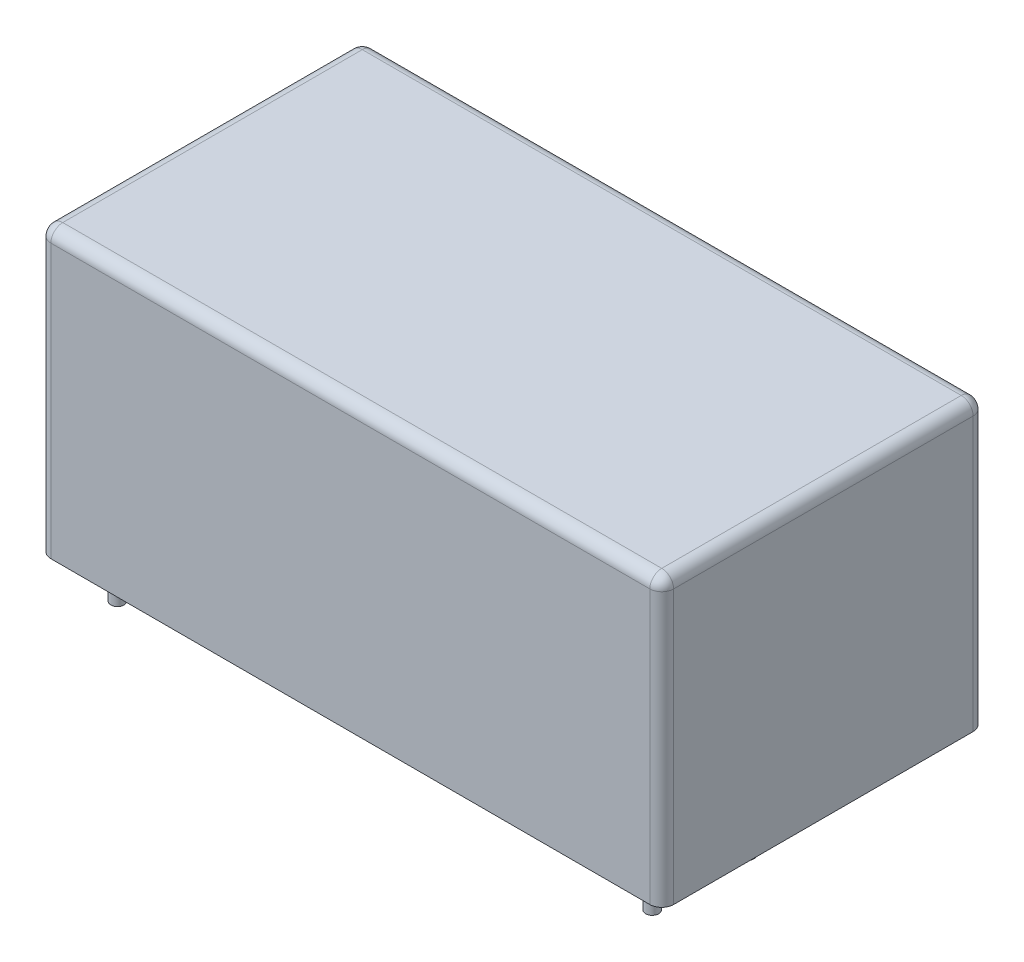
ISO-10303-21;
HEADER;
FILE_DESCRIPTION(('STEP AP214'),'2;1');
FILE_NAME('part.step','',(''),(''),'','','');
FILE_SCHEMA(('AUTOMOTIVE_DESIGN { 1 0 10303 214 1 1 1 1 }'));
ENDSEC;
DATA;
#1=APPLICATION_CONTEXT('core data for automotive mechanical design processes');
#2=APPLICATION_PROTOCOL_DEFINITION('international standard','automotive_design',2000,#1);
#3=PRODUCT_CONTEXT('',#1,'mechanical');
#4=PRODUCT('Part','Part','',(#3));
#5=PRODUCT_RELATED_PRODUCT_CATEGORY('part','',(#4));
#6=PRODUCT_DEFINITION_FORMATION('','',#4);
#7=PRODUCT_DEFINITION_CONTEXT('part definition',#1,'design');
#8=PRODUCT_DEFINITION('design','',#6,#7);
#9=PRODUCT_DEFINITION_SHAPE('','',#8);
#10=(LENGTH_UNIT() NAMED_UNIT(*) SI_UNIT(.MILLI.,.METRE.));
#11=(NAMED_UNIT(*) PLANE_ANGLE_UNIT() SI_UNIT($,.RADIAN.));
#12=(NAMED_UNIT(*) SI_UNIT($,.STERADIAN.) SOLID_ANGLE_UNIT());
#13=UNCERTAINTY_MEASURE_WITH_UNIT(LENGTH_MEASURE(1.E-05),#10,'distance_accuracy_value','');
#14=(GEOMETRIC_REPRESENTATION_CONTEXT(3) GLOBAL_UNCERTAINTY_ASSIGNED_CONTEXT((#13)) GLOBAL_UNIT_ASSIGNED_CONTEXT((#10,
#11,#12)) REPRESENTATION_CONTEXT('',''));
#15=CARTESIAN_POINT('',(0.,0.,0.));
#16=DIRECTION('',(0.,0.,1.));
#17=DIRECTION('',(1.,0.,0.));
#18=AXIS2_PLACEMENT_3D('',#15,#16,#17);
#19=CARTESIAN_POINT('',(25.2,24.,-12.6));
#20=DIRECTION('',(0.,-1.,0.));
#21=DIRECTION('',(0.,0.,-1.));
#22=AXIS2_PLACEMENT_3D('',#19,#20,#21);
#23=CYLINDRICAL_SURFACE('',#22,1.);
#24=DIRECTION('',(0.,-1.,0.));
#25=VECTOR('',#24,1.);
#26=CARTESIAN_POINT('',(25.2,24.,-13.6));
#27=LINE('',#26,#25);
#28=CARTESIAN_POINT('',(25.2,23.,-13.6));
#29=VERTEX_POINT('',#28);
#30=CARTESIAN_POINT('',(25.2,0.,-13.6));
#31=VERTEX_POINT('',#30);
#32=EDGE_CURVE('E115',#29,#31,#27,.T.);
#33=ORIENTED_EDGE('',*,*,#32,.F.);
#34=CARTESIAN_POINT('',(25.2,23.,-12.6));
#35=DIRECTION('',(0.,-1.,0.));
#36=DIRECTION('',(0.,0.,-1.));
#37=AXIS2_PLACEMENT_3D('',#34,#35,#36);
#38=CIRCLE('',#37,1.);
#39=CARTESIAN_POINT('',(26.2,23.,-12.6));
#40=VERTEX_POINT('',#39);
#41=EDGE_CURVE('E179',#29,#40,#38,.T.);
#42=ORIENTED_EDGE('',*,*,#41,.T.);
#43=DIRECTION('',(0.,-1.,0.));
#44=VECTOR('',#43,1.);
#45=CARTESIAN_POINT('',(26.2,24.,-12.6));
#46=LINE('',#45,#44);
#47=CARTESIAN_POINT('',(26.2,0.,-12.6));
#48=VERTEX_POINT('',#47);
#49=EDGE_CURVE('E139',#40,#48,#46,.T.);
#50=ORIENTED_EDGE('',*,*,#49,.T.);
#51=CARTESIAN_POINT('',(25.2,0.,-12.6));
#52=DIRECTION('',(0.,1.,0.));
#53=DIRECTION('',(0.,0.,-1.));
#54=AXIS2_PLACEMENT_3D('',#51,#52,#53);
#55=CIRCLE('',#54,1.);
#56=EDGE_CURVE('E133',#48,#31,#55,.T.);
#57=ORIENTED_EDGE('',*,*,#56,.T.);
#58=EDGE_LOOP('',(#33,#42,#50,#57));
#59=FACE_BOUND('',#58,.T.);
#60=ADVANCED_FACE('F37',(#59),#23,.T.);
#61=CARTESIAN_POINT('',(-25.2,24.,-13.6));
#62=DIRECTION('',(0.,0.,1.));
#63=DIRECTION('',(1.,0.,0.));
#64=AXIS2_PLACEMENT_3D('',#61,#62,#63);
#65=PLANE('',#64);
#66=DIRECTION('',(0.,-1.,0.));
#67=VECTOR('',#66,1.);
#68=CARTESIAN_POINT('',(-25.2,24.,-13.6));
#69=LINE('',#68,#67);
#70=CARTESIAN_POINT('',(-25.2,23.,-13.6));
#71=VERTEX_POINT('',#70);
#72=CARTESIAN_POINT('',(-25.2,0.,-13.6));
#73=VERTEX_POINT('',#72);
#74=EDGE_CURVE('E127',#71,#73,#69,.T.);
#75=ORIENTED_EDGE('',*,*,#74,.F.);
#76=DIRECTION('',(-1.,0.,0.));
#77=VECTOR('',#76,1.);
#78=CARTESIAN_POINT('',(-25.2,23.,-13.6));
#79=LINE('',#78,#77);
#80=EDGE_CURVE('E122',#71,#29,#79,.F.);
#81=ORIENTED_EDGE('',*,*,#80,.T.);
#82=ORIENTED_EDGE('',*,*,#32,.T.);
#83=DIRECTION('',(-1.,0.,0.));
#84=VECTOR('',#83,1.);
#85=CARTESIAN_POINT('',(-25.2,0.,-13.6));
#86=LINE('',#85,#84);
#87=EDGE_CURVE('E119',#31,#73,#86,.T.);
#88=ORIENTED_EDGE('',*,*,#87,.T.);
#89=EDGE_LOOP('',(#75,#81,#82,#88));
#90=FACE_BOUND('',#89,.T.);
#91=ADVANCED_FACE('F118',(#90),#65,.F.);
#92=CARTESIAN_POINT('',(-25.2,24.,-12.6));
#93=DIRECTION('',(0.,-1.,0.));
#94=DIRECTION('',(0.,0.,-1.));
#95=AXIS2_PLACEMENT_3D('',#92,#93,#94);
#96=CYLINDRICAL_SURFACE('',#95,1.);
#97=DIRECTION('',(0.,-1.,0.));
#98=VECTOR('',#97,1.);
#99=CARTESIAN_POINT('',(-26.2,24.,-12.6));
#100=LINE('',#99,#98);
#101=CARTESIAN_POINT('',(-26.2,23.,-12.6));
#102=VERTEX_POINT('',#101);
#103=CARTESIAN_POINT('',(-26.2,0.,-12.6));
#104=VERTEX_POINT('',#103);
#105=EDGE_CURVE('E172',#102,#104,#100,.T.);
#106=ORIENTED_EDGE('',*,*,#105,.F.);
#107=CARTESIAN_POINT('',(-25.2,23.,-12.6));
#108=DIRECTION('',(0.,-1.,0.));
#109=DIRECTION('',(0.,0.,-1.));
#110=AXIS2_PLACEMENT_3D('',#107,#108,#109);
#111=CIRCLE('',#110,1.);
#112=EDGE_CURVE('E177',#102,#71,#111,.T.);
#113=ORIENTED_EDGE('',*,*,#112,.T.);
#114=ORIENTED_EDGE('',*,*,#74,.T.);
#115=CARTESIAN_POINT('',(-25.2,0.,-12.6));
#116=DIRECTION('',(0.,1.,0.));
#117=DIRECTION('',(0.,0.,-1.));
#118=AXIS2_PLACEMENT_3D('',#115,#116,#117);
#119=CIRCLE('',#118,1.);
#120=EDGE_CURVE('E136',#73,#104,#119,.T.);
#121=ORIENTED_EDGE('',*,*,#120,.T.);
#122=EDGE_LOOP('',(#106,#113,#114,#121));
#123=FACE_BOUND('',#122,.T.);
#124=ADVANCED_FACE('F263',(#123),#96,.T.);
#125=CARTESIAN_POINT('',(-26.2,24.,-12.6));
#126=DIRECTION('',(1.,0.,0.));
#127=DIRECTION('',(0.,0.,-1.));
#128=AXIS2_PLACEMENT_3D('',#125,#126,#127);
#129=PLANE('',#128);
#130=DIRECTION('',(0.,-1.,0.));
#131=VECTOR('',#130,1.);
#132=CARTESIAN_POINT('',(-26.2,24.,12.6));
#133=LINE('',#132,#131);
#134=CARTESIAN_POINT('',(-26.2,23.,12.6));
#135=VERTEX_POINT('',#134);
#136=CARTESIAN_POINT('',(-26.2,0.,12.6));
#137=VERTEX_POINT('',#136);
#138=EDGE_CURVE('E170',#135,#137,#133,.T.);
#139=ORIENTED_EDGE('',*,*,#138,.F.);
#140=DIRECTION('',(0.,0.,1.));
#141=VECTOR('',#140,1.);
#142=CARTESIAN_POINT('',(-26.2,23.,-12.6));
#143=LINE('',#142,#141);
#144=EDGE_CURVE('E189',#135,#102,#143,.F.);
#145=ORIENTED_EDGE('',*,*,#144,.T.);
#146=ORIENTED_EDGE('',*,*,#105,.T.);
#147=DIRECTION('',(0.,0.,1.));
#148=VECTOR('',#147,1.);
#149=CARTESIAN_POINT('',(-26.2,0.,-12.6));
#150=LINE('',#149,#148);
#151=EDGE_CURVE('E149',#104,#137,#150,.T.);
#152=ORIENTED_EDGE('',*,*,#151,.T.);
#153=EDGE_LOOP('',(#139,#145,#146,#152));
#154=FACE_BOUND('',#153,.T.);
#155=ADVANCED_FACE('F454',(#154),#129,.F.);
#156=CARTESIAN_POINT('',(-25.2,24.,12.6));
#157=DIRECTION('',(0.,-1.,0.));
#158=DIRECTION('',(0.,0.,-1.));
#159=AXIS2_PLACEMENT_3D('',#156,#157,#158);
#160=CYLINDRICAL_SURFACE('',#159,0.999999999999998);
#161=DIRECTION('',(0.,-1.,0.));
#162=VECTOR('',#161,1.);
#163=CARTESIAN_POINT('',(-25.2,24.,13.6));
#164=LINE('',#163,#162);
#165=CARTESIAN_POINT('',(-25.2,23.,13.6));
#166=VERTEX_POINT('',#165);
#167=CARTESIAN_POINT('',(-25.2,0.,13.6));
#168=VERTEX_POINT('',#167);
#169=EDGE_CURVE('E168',#166,#168,#164,.T.);
#170=ORIENTED_EDGE('',*,*,#169,.F.);
#171=CARTESIAN_POINT('',(-25.2,23.,12.6));
#172=DIRECTION('',(0.,-1.,0.));
#173=DIRECTION('',(0.,0.,-1.));
#174=AXIS2_PLACEMENT_3D('',#171,#172,#173);
#175=CIRCLE('',#174,0.999999999999998);
#176=EDGE_CURVE('E126',#166,#135,#175,.T.);
#177=ORIENTED_EDGE('',*,*,#176,.T.);
#178=ORIENTED_EDGE('',*,*,#138,.T.);
#179=CARTESIAN_POINT('',(-25.2,0.,12.6));
#180=DIRECTION('',(0.,1.,0.));
#181=DIRECTION('',(0.,0.,-1.));
#182=AXIS2_PLACEMENT_3D('',#179,#180,#181);
#183=CIRCLE('',#182,0.999999999999998);
#184=EDGE_CURVE('E152',#137,#168,#183,.T.);
#185=ORIENTED_EDGE('',*,*,#184,.T.);
#186=EDGE_LOOP('',(#170,#177,#178,#185));
#187=FACE_BOUND('',#186,.T.);
#188=ADVANCED_FACE('F445',(#187),#160,.T.);
#189=CARTESIAN_POINT('',(-25.2,24.,13.6));
#190=DIRECTION('',(0.,0.,-1.));
#191=DIRECTION('',(-1.,0.,0.));
#192=AXIS2_PLACEMENT_3D('',#189,#190,#191);
#193=PLANE('',#192);
#194=DIRECTION('',(0.,-1.,0.));
#195=VECTOR('',#194,1.);
#196=CARTESIAN_POINT('',(25.2,24.,13.6));
#197=LINE('',#196,#195);
#198=CARTESIAN_POINT('',(25.2,23.,13.6));
#199=VERTEX_POINT('',#198);
#200=CARTESIAN_POINT('',(25.2,0.,13.6));
#201=VERTEX_POINT('',#200);
#202=EDGE_CURVE('E166',#199,#201,#197,.T.);
#203=ORIENTED_EDGE('',*,*,#202,.F.);
#204=DIRECTION('',(1.,0.,0.));
#205=VECTOR('',#204,1.);
#206=CARTESIAN_POINT('',(-25.2,23.,13.6));
#207=LINE('',#206,#205);
#208=EDGE_CURVE('E11',#199,#166,#207,.F.);
#209=ORIENTED_EDGE('',*,*,#208,.T.);
#210=ORIENTED_EDGE('',*,*,#169,.T.);
#211=DIRECTION('',(1.,0.,0.));
#212=VECTOR('',#211,1.);
#213=CARTESIAN_POINT('',(-25.2,0.,13.6));
#214=LINE('',#213,#212);
#215=EDGE_CURVE('E155',#168,#201,#214,.T.);
#216=ORIENTED_EDGE('',*,*,#215,.T.);
#217=EDGE_LOOP('',(#203,#209,#210,#216));
#218=FACE_BOUND('',#217,.T.);
#219=ADVANCED_FACE('F242',(#218),#193,.F.);
#220=CARTESIAN_POINT('',(25.2,24.,12.6));
#221=DIRECTION('',(0.,-1.,0.));
#222=DIRECTION('',(0.,0.,-1.));
#223=AXIS2_PLACEMENT_3D('',#220,#221,#222);
#224=CYLINDRICAL_SURFACE('',#223,1.);
#225=DIRECTION('',(0.,-1.,0.));
#226=VECTOR('',#225,1.);
#227=CARTESIAN_POINT('',(26.2,24.,12.6));
#228=LINE('',#227,#226);
#229=CARTESIAN_POINT('',(26.2,23.,12.6));
#230=VERTEX_POINT('',#229);
#231=CARTESIAN_POINT('',(26.2,0.,12.6));
#232=VERTEX_POINT('',#231);
#233=EDGE_CURVE('E164',#230,#232,#228,.T.);
#234=ORIENTED_EDGE('',*,*,#233,.F.);
#235=CARTESIAN_POINT('',(25.2,23.,12.6));
#236=DIRECTION('',(0.,-1.,0.));
#237=DIRECTION('',(0.,0.,-1.));
#238=AXIS2_PLACEMENT_3D('',#235,#236,#237);
#239=CIRCLE('',#238,1.);
#240=EDGE_CURVE('E181',#230,#199,#239,.T.);
#241=ORIENTED_EDGE('',*,*,#240,.T.);
#242=ORIENTED_EDGE('',*,*,#202,.T.);
#243=CARTESIAN_POINT('',(25.2,0.,12.6));
#244=DIRECTION('',(0.,1.,0.));
#245=DIRECTION('',(0.,0.,-1.));
#246=AXIS2_PLACEMENT_3D('',#243,#244,#245);
#247=CIRCLE('',#246,1.);
#248=EDGE_CURVE('E158',#201,#232,#247,.T.);
#249=ORIENTED_EDGE('',*,*,#248,.T.);
#250=EDGE_LOOP('',(#234,#241,#242,#249));
#251=FACE_BOUND('',#250,.T.);
#252=ADVANCED_FACE('F240',(#251),#224,.T.);
#253=CARTESIAN_POINT('',(26.2,24.,-12.6));
#254=DIRECTION('',(-1.,0.,0.));
#255=DIRECTION('',(0.,0.,1.));
#256=AXIS2_PLACEMENT_3D('',#253,#254,#255);
#257=PLANE('',#256);
#258=ORIENTED_EDGE('',*,*,#49,.F.);
#259=DIRECTION('',(0.,0.,-1.));
#260=VECTOR('',#259,1.);
#261=CARTESIAN_POINT('',(26.2,23.,-12.6));
#262=LINE('',#261,#260);
#263=EDGE_CURVE('E46',#40,#230,#262,.F.);
#264=ORIENTED_EDGE('',*,*,#263,.T.);
#265=ORIENTED_EDGE('',*,*,#233,.T.);
#266=DIRECTION('',(0.,0.,-1.));
#267=VECTOR('',#266,1.);
#268=CARTESIAN_POINT('',(26.2,0.,-12.6));
#269=LINE('',#268,#267);
#270=EDGE_CURVE('E161',#232,#48,#269,.T.);
#271=ORIENTED_EDGE('',*,*,#270,.T.);
#272=EDGE_LOOP('',(#258,#264,#265,#271));
#273=FACE_BOUND('',#272,.T.);
#274=ADVANCED_FACE('F248',(#273),#257,.F.);
#275=CARTESIAN_POINT('',(25.2,24.,-12.6));
#276=DIRECTION('',(0.,-1.,0.));
#277=DIRECTION('',(0.,0.,-1.));
#278=AXIS2_PLACEMENT_3D('',#275,#276,#277);
#279=PLANE('',#278);
#280=DIRECTION('',(-1.,0.,0.));
#281=VECTOR('',#280,1.);
#282=CARTESIAN_POINT('',(25.2,24.,-12.6));
#283=LINE('',#282,#281);
#284=CARTESIAN_POINT('',(25.2,24.,-12.6));
#285=VERTEX_POINT('',#284);
#286=CARTESIAN_POINT('',(-25.2,24.,-12.6));
#287=VERTEX_POINT('',#286);
#288=EDGE_CURVE('E54',#285,#287,#283,.T.);
#289=ORIENTED_EDGE('',*,*,#288,.T.);
#290=DIRECTION('',(0.,0.,1.));
#291=VECTOR('',#290,1.);
#292=CARTESIAN_POINT('',(-25.2,24.,-12.6));
#293=LINE('',#292,#291);
#294=CARTESIAN_POINT('',(-25.2,24.,12.6));
#295=VERTEX_POINT('',#294);
#296=EDGE_CURVE('E187',#287,#295,#293,.T.);
#297=ORIENTED_EDGE('',*,*,#296,.T.);
#298=DIRECTION('',(1.,0.,0.));
#299=VECTOR('',#298,1.);
#300=CARTESIAN_POINT('',(25.2,24.,12.6));
#301=LINE('',#300,#299);
#302=CARTESIAN_POINT('',(25.2,24.,12.6));
#303=VERTEX_POINT('',#302);
#304=EDGE_CURVE('E183',#295,#303,#301,.T.);
#305=ORIENTED_EDGE('',*,*,#304,.T.);
#306=DIRECTION('',(0.,0.,-1.));
#307=VECTOR('',#306,1.);
#308=CARTESIAN_POINT('',(25.2,24.,-12.6));
#309=LINE('',#308,#307);
#310=EDGE_CURVE('E59',#303,#285,#309,.T.);
#311=ORIENTED_EDGE('',*,*,#310,.T.);
#312=EDGE_LOOP('',(#289,#297,#305,#311));
#313=FACE_BOUND('',#312,.T.);
#314=ADVANCED_FACE('F228',(#313),#279,.F.);
#315=CARTESIAN_POINT('',(25.2,0.,-12.6));
#316=DIRECTION('',(0.,-1.,0.));
#317=DIRECTION('',(0.,0.,-1.));
#318=AXIS2_PLACEMENT_3D('',#315,#316,#317);
#319=PLANE('',#318);
#320=CARTESIAN_POINT('',(22.2,0.,10.4));
#321=DIRECTION('',(0.,-1.,0.));
#322=DIRECTION('',(0.,0.,-1.));
#323=AXIS2_PLACEMENT_3D('',#320,#321,#322);
#324=CIRCLE('',#323,0.55);
#325=CARTESIAN_POINT('',(22.2,0.,9.85));
#326=VERTEX_POINT('',#325);
#327=EDGE_CURVE('E330',#326,#326,#324,.T.);
#328=ORIENTED_EDGE('',*,*,#327,.F.);
#329=EDGE_LOOP('',(#328));
#330=FACE_BOUND('',#329,.T.);
#331=CARTESIAN_POINT('',(22.2,0.,2.4));
#332=DIRECTION('',(0.,-1.,0.));
#333=DIRECTION('',(0.,0.,-1.));
#334=AXIS2_PLACEMENT_3D('',#331,#332,#333);
#335=CIRCLE('',#334,0.549999999999999);
#336=CARTESIAN_POINT('',(22.2,0.,1.85));
#337=VERTEX_POINT('',#336);
#338=EDGE_CURVE('E329',#337,#337,#335,.T.);
#339=ORIENTED_EDGE('',*,*,#338,.F.);
#340=EDGE_LOOP('',(#339));
#341=FACE_BOUND('',#340,.T.);
#342=CARTESIAN_POINT('',(-22.8,0.,-10.4));
#343=DIRECTION('',(0.,-1.,0.));
#344=DIRECTION('',(0.,0.,-1.));
#345=AXIS2_PLACEMENT_3D('',#342,#343,#344);
#346=CIRCLE('',#345,0.550000000000003);
#347=CARTESIAN_POINT('',(-22.8,0.,-10.95));
#348=VERTEX_POINT('',#347);
#349=EDGE_CURVE('E339',#348,#348,#346,.T.);
#350=ORIENTED_EDGE('',*,*,#349,.F.);
#351=EDGE_LOOP('',(#350));
#352=FACE_BOUND('',#351,.T.);
#353=CARTESIAN_POINT('',(-22.8,0.,10.4));
#354=DIRECTION('',(0.,-1.,0.));
#355=DIRECTION('',(0.,0.,-1.));
#356=AXIS2_PLACEMENT_3D('',#353,#354,#355);
#357=CIRCLE('',#356,0.55);
#358=CARTESIAN_POINT('',(-22.8,0.,9.85));
#359=VERTEX_POINT('',#358);
#360=EDGE_CURVE('E145',#359,#359,#357,.T.);
#361=ORIENTED_EDGE('',*,*,#360,.F.);
#362=EDGE_LOOP('',(#361));
#363=FACE_BOUND('',#362,.T.);
#364=ORIENTED_EDGE('',*,*,#56,.F.);
#365=ORIENTED_EDGE('',*,*,#270,.F.);
#366=ORIENTED_EDGE('',*,*,#248,.F.);
#367=ORIENTED_EDGE('',*,*,#215,.F.);
#368=ORIENTED_EDGE('',*,*,#184,.F.);
#369=ORIENTED_EDGE('',*,*,#151,.F.);
#370=ORIENTED_EDGE('',*,*,#120,.F.);
#371=ORIENTED_EDGE('',*,*,#87,.F.);
#372=EDGE_LOOP('',(#364,#365,#366,#367,#368,#369,#370,#371));
#373=FACE_BOUND('',#372,.T.);
#374=ADVANCED_FACE('F131',(#330,#341,#352,#363,#373),#319,.T.);
#375=CARTESIAN_POINT('',(25.2,23.,-12.6));
#376=DIRECTION('',(0.,-1.,0.));
#377=DIRECTION('',(0.,0.,-1.));
#378=AXIS2_PLACEMENT_3D('',#375,#376,#377);
#379=SPHERICAL_SURFACE('',#378,1.);
#380=CARTESIAN_POINT('',(25.2,23.,-12.6));
#381=DIRECTION('',(0.,0.,1.));
#382=DIRECTION('',(1.,0.,0.));
#383=AXIS2_PLACEMENT_3D('',#380,#381,#382);
#384=CIRCLE('',#383,1.);
#385=EDGE_CURVE('E143',#40,#285,#384,.T.);
#386=ORIENTED_EDGE('',*,*,#385,.F.);
#387=ORIENTED_EDGE('',*,*,#41,.F.);
#388=CARTESIAN_POINT('',(25.2,23.,-12.6));
#389=DIRECTION('',(-1.,0.,0.));
#390=DIRECTION('',(0.,0.,1.));
#391=AXIS2_PLACEMENT_3D('',#388,#389,#390);
#392=CIRCLE('',#391,1.);
#393=EDGE_CURVE('E41',#285,#29,#392,.T.);
#394=ORIENTED_EDGE('',*,*,#393,.F.);
#395=EDGE_LOOP('',(#386,#387,#394));
#396=FACE_BOUND('',#395,.T.);
#397=ADVANCED_FACE('F39',(#396),#379,.T.);
#398=CARTESIAN_POINT('',(25.2,23.,-12.6));
#399=DIRECTION('',(-1.,0.,0.));
#400=DIRECTION('',(0.,0.,1.));
#401=AXIS2_PLACEMENT_3D('',#398,#399,#400);
#402=CYLINDRICAL_SURFACE('',#401,1.);
#403=ORIENTED_EDGE('',*,*,#393,.T.);
#404=ORIENTED_EDGE('',*,*,#80,.F.);
#405=CARTESIAN_POINT('',(-25.2,23.,-12.6));
#406=DIRECTION('',(-1.,0.,0.));
#407=DIRECTION('',(0.,0.,1.));
#408=AXIS2_PLACEMENT_3D('',#405,#406,#407);
#409=CIRCLE('',#408,1.);
#410=EDGE_CURVE('E207',#287,#71,#409,.T.);
#411=ORIENTED_EDGE('',*,*,#410,.F.);
#412=ORIENTED_EDGE('',*,*,#288,.F.);
#413=EDGE_LOOP('',(#403,#404,#411,#412));
#414=FACE_BOUND('',#413,.T.);
#415=ADVANCED_FACE('F217',(#414),#402,.T.);
#416=CARTESIAN_POINT('',(25.2,23.,-12.6));
#417=DIRECTION('',(0.,0.,-1.));
#418=DIRECTION('',(-1.,0.,0.));
#419=AXIS2_PLACEMENT_3D('',#416,#417,#418);
#420=CYLINDRICAL_SURFACE('',#419,1.);
#421=ORIENTED_EDGE('',*,*,#385,.T.);
#422=ORIENTED_EDGE('',*,*,#310,.F.);
#423=CARTESIAN_POINT('',(25.2,23.,12.6));
#424=DIRECTION('',(0.,0.,1.));
#425=DIRECTION('',(1.,0.,0.));
#426=AXIS2_PLACEMENT_3D('',#423,#424,#425);
#427=CIRCLE('',#426,1.);
#428=EDGE_CURVE('E204',#230,#303,#427,.T.);
#429=ORIENTED_EDGE('',*,*,#428,.F.);
#430=ORIENTED_EDGE('',*,*,#263,.F.);
#431=EDGE_LOOP('',(#421,#422,#429,#430));
#432=FACE_BOUND('',#431,.T.);
#433=ADVANCED_FACE('F213',(#432),#420,.T.);
#434=CARTESIAN_POINT('',(-25.2,23.,-12.6));
#435=DIRECTION('',(0.,-1.,0.));
#436=DIRECTION('',(0.,0.,-1.));
#437=AXIS2_PLACEMENT_3D('',#434,#435,#436);
#438=SPHERICAL_SURFACE('',#437,1.);
#439=ORIENTED_EDGE('',*,*,#410,.T.);
#440=ORIENTED_EDGE('',*,*,#112,.F.);
#441=CARTESIAN_POINT('',(-25.2,23.,-12.6));
#442=DIRECTION('',(0.,0.,1.));
#443=DIRECTION('',(1.,0.,0.));
#444=AXIS2_PLACEMENT_3D('',#441,#442,#443);
#445=CIRCLE('',#444,1.);
#446=EDGE_CURVE('E201',#287,#102,#445,.T.);
#447=ORIENTED_EDGE('',*,*,#446,.F.);
#448=EDGE_LOOP('',(#439,#440,#447));
#449=FACE_BOUND('',#448,.T.);
#450=ADVANCED_FACE('F222',(#449),#438,.T.);
#451=CARTESIAN_POINT('',(25.2,23.,12.6));
#452=DIRECTION('',(0.,-1.,0.));
#453=DIRECTION('',(0.,0.,-1.));
#454=AXIS2_PLACEMENT_3D('',#451,#452,#453);
#455=SPHERICAL_SURFACE('',#454,1.);
#456=ORIENTED_EDGE('',*,*,#240,.F.);
#457=ORIENTED_EDGE('',*,*,#428,.T.);
#458=CARTESIAN_POINT('',(25.2,23.,12.6));
#459=DIRECTION('',(-1.,0.,0.));
#460=DIRECTION('',(0.,0.,1.));
#461=AXIS2_PLACEMENT_3D('',#458,#459,#460);
#462=CIRCLE('',#461,1.);
#463=EDGE_CURVE('E198',#199,#303,#462,.T.);
#464=ORIENTED_EDGE('',*,*,#463,.F.);
#465=EDGE_LOOP('',(#456,#457,#464));
#466=FACE_BOUND('',#465,.T.);
#467=ADVANCED_FACE('F236',(#466),#455,.T.);
#468=CARTESIAN_POINT('',(-25.2,23.,-12.6));
#469=DIRECTION('',(0.,0.,1.));
#470=DIRECTION('',(1.,0.,0.));
#471=AXIS2_PLACEMENT_3D('',#468,#469,#470);
#472=CYLINDRICAL_SURFACE('',#471,1.);
#473=ORIENTED_EDGE('',*,*,#446,.T.);
#474=ORIENTED_EDGE('',*,*,#144,.F.);
#475=CARTESIAN_POINT('',(-25.2,23.,12.6));
#476=DIRECTION('',(0.,0.,1.));
#477=DIRECTION('',(1.,0.,0.));
#478=AXIS2_PLACEMENT_3D('',#475,#476,#477);
#479=CIRCLE('',#478,1.);
#480=EDGE_CURVE('E195',#295,#135,#479,.T.);
#481=ORIENTED_EDGE('',*,*,#480,.F.);
#482=ORIENTED_EDGE('',*,*,#296,.F.);
#483=EDGE_LOOP('',(#473,#474,#481,#482));
#484=FACE_BOUND('',#483,.T.);
#485=ADVANCED_FACE('F226',(#484),#472,.T.);
#486=CARTESIAN_POINT('',(25.2,23.,12.6));
#487=DIRECTION('',(1.,0.,0.));
#488=DIRECTION('',(0.,0.,-1.));
#489=AXIS2_PLACEMENT_3D('',#486,#487,#488);
#490=CYLINDRICAL_SURFACE('',#489,1.);
#491=ORIENTED_EDGE('',*,*,#463,.T.);
#492=ORIENTED_EDGE('',*,*,#304,.F.);
#493=CARTESIAN_POINT('',(-25.2,23.,12.6));
#494=DIRECTION('',(-1.,0.,0.));
#495=DIRECTION('',(0.,-1.,0.));
#496=AXIS2_PLACEMENT_3D('',#493,#494,#495);
#497=CIRCLE('',#496,1.);
#498=EDGE_CURVE('E193',#166,#295,#497,.T.);
#499=ORIENTED_EDGE('',*,*,#498,.F.);
#500=ORIENTED_EDGE('',*,*,#208,.F.);
#501=EDGE_LOOP('',(#491,#492,#499,#500));
#502=FACE_BOUND('',#501,.T.);
#503=ADVANCED_FACE('F231',(#502),#490,.T.);
#504=CARTESIAN_POINT('',(-25.2,23.,12.6));
#505=DIRECTION('',(0.,-1.,0.));
#506=DIRECTION('',(0.,0.,-1.));
#507=AXIS2_PLACEMENT_3D('',#504,#505,#506);
#508=SPHERICAL_SURFACE('',#507,1.);
#509=ORIENTED_EDGE('',*,*,#480,.T.);
#510=ORIENTED_EDGE('',*,*,#176,.F.);
#511=ORIENTED_EDGE('',*,*,#498,.T.);
#512=EDGE_LOOP('',(#509,#510,#511));
#513=FACE_BOUND('',#512,.T.);
#514=ADVANCED_FACE('F267',(#513),#508,.T.);
#515=CARTESIAN_POINT('',(-22.8,-3.5,10.4));
#516=DIRECTION('',(0.,1.,0.));
#517=DIRECTION('',(0.,0.,1.));
#518=AXIS2_PLACEMENT_3D('',#515,#516,#517);
#519=CYLINDRICAL_SURFACE('',#518,0.55);
#520=CARTESIAN_POINT('',(-22.8,-3.5,10.4));
#521=DIRECTION('',(0.,-1.,0.));
#522=DIRECTION('',(0.,0.,-1.));
#523=AXIS2_PLACEMENT_3D('',#520,#521,#522);
#524=CIRCLE('',#523,0.55);
#525=CARTESIAN_POINT('',(-22.8,-3.5,9.85));
#526=VERTEX_POINT('',#525);
#527=EDGE_CURVE('E196',#526,#526,#524,.T.);
#528=ORIENTED_EDGE('',*,*,#527,.F.);
#529=EDGE_LOOP('',(#528));
#530=FACE_BOUND('',#529,.T.);
#531=ORIENTED_EDGE('',*,*,#360,.T.);
#532=EDGE_LOOP('',(#531));
#533=FACE_BOUND('',#532,.T.);
#534=ADVANCED_FACE('F270',(#530,#533),#519,.T.);
#535=CARTESIAN_POINT('',(-22.8,-3.5,10.4));
#536=DIRECTION('',(0.,-1.,0.));
#537=DIRECTION('',(0.,0.,-1.));
#538=AXIS2_PLACEMENT_3D('',#535,#536,#537);
#539=PLANE('',#538);
#540=ORIENTED_EDGE('',*,*,#527,.T.);
#541=EDGE_LOOP('',(#540));
#542=FACE_BOUND('',#541,.T.);
#543=ADVANCED_FACE('F296',(#542),#539,.T.);
#544=CARTESIAN_POINT('',(-22.8,-3.5,-10.4));
#545=DIRECTION('',(0.,1.,0.));
#546=DIRECTION('',(0.,0.,1.));
#547=AXIS2_PLACEMENT_3D('',#544,#545,#546);
#548=CYLINDRICAL_SURFACE('',#547,0.550000000000003);
#549=CARTESIAN_POINT('',(-22.8,-3.5,-10.4));
#550=DIRECTION('',(0.,-1.,0.));
#551=DIRECTION('',(0.,0.,-1.));
#552=AXIS2_PLACEMENT_3D('',#549,#550,#551);
#553=CIRCLE('',#552,0.550000000000003);
#554=CARTESIAN_POINT('',(-22.8,-3.5,-10.95));
#555=VERTEX_POINT('',#554);
#556=EDGE_CURVE('E341',#555,#555,#553,.T.);
#557=ORIENTED_EDGE('',*,*,#556,.F.);
#558=EDGE_LOOP('',(#557));
#559=FACE_BOUND('',#558,.T.);
#560=ORIENTED_EDGE('',*,*,#349,.T.);
#561=EDGE_LOOP('',(#560));
#562=FACE_BOUND('',#561,.T.);
#563=ADVANCED_FACE('F300',(#559,#562),#548,.T.);
#564=CARTESIAN_POINT('',(-22.8,-3.5,-10.4));
#565=DIRECTION('',(0.,-1.,0.));
#566=DIRECTION('',(0.,0.,-1.));
#567=AXIS2_PLACEMENT_3D('',#564,#565,#566);
#568=PLANE('',#567);
#569=ORIENTED_EDGE('',*,*,#556,.T.);
#570=EDGE_LOOP('',(#569));
#571=FACE_BOUND('',#570,.T.);
#572=ADVANCED_FACE('F304',(#571),#568,.T.);
#573=CARTESIAN_POINT('',(22.2,-3.5,2.4));
#574=DIRECTION('',(0.,1.,0.));
#575=DIRECTION('',(0.,0.,1.));
#576=AXIS2_PLACEMENT_3D('',#573,#574,#575);
#577=CYLINDRICAL_SURFACE('',#576,0.549999999999999);
#578=CARTESIAN_POINT('',(22.2,-3.5,2.4));
#579=DIRECTION('',(0.,-1.,0.));
#580=DIRECTION('',(0.,0.,-1.));
#581=AXIS2_PLACEMENT_3D('',#578,#579,#580);
#582=CIRCLE('',#581,0.549999999999999);
#583=CARTESIAN_POINT('',(22.2,-3.5,1.85));
#584=VERTEX_POINT('',#583);
#585=EDGE_CURVE('E333',#584,#584,#582,.T.);
#586=ORIENTED_EDGE('',*,*,#585,.F.);
#587=EDGE_LOOP('',(#586));
#588=FACE_BOUND('',#587,.T.);
#589=ORIENTED_EDGE('',*,*,#338,.T.);
#590=EDGE_LOOP('',(#589));
#591=FACE_BOUND('',#590,.T.);
#592=ADVANCED_FACE('F308',(#588,#591),#577,.T.);
#593=CARTESIAN_POINT('',(22.2,-3.5,2.4));
#594=DIRECTION('',(0.,-1.,0.));
#595=DIRECTION('',(0.,0.,-1.));
#596=AXIS2_PLACEMENT_3D('',#593,#594,#595);
#597=PLANE('',#596);
#598=ORIENTED_EDGE('',*,*,#585,.T.);
#599=EDGE_LOOP('',(#598));
#600=FACE_BOUND('',#599,.T.);
#601=ADVANCED_FACE('F312',(#600),#597,.T.);
#602=CARTESIAN_POINT('',(22.2,-3.5,10.4));
#603=DIRECTION('',(0.,1.,0.));
#604=DIRECTION('',(0.,0.,1.));
#605=AXIS2_PLACEMENT_3D('',#602,#603,#604);
#606=CYLINDRICAL_SURFACE('',#605,0.55);
#607=CARTESIAN_POINT('',(22.2,-3.5,10.4));
#608=DIRECTION('',(0.,-1.,0.));
#609=DIRECTION('',(0.,0.,-1.));
#610=AXIS2_PLACEMENT_3D('',#607,#608,#609);
#611=CIRCLE('',#610,0.55);
#612=CARTESIAN_POINT('',(22.2,-3.5,9.85));
#613=VERTEX_POINT('',#612);
#614=EDGE_CURVE('E328',#613,#613,#611,.T.);
#615=ORIENTED_EDGE('',*,*,#614,.F.);
#616=EDGE_LOOP('',(#615));
#617=FACE_BOUND('',#616,.T.);
#618=ORIENTED_EDGE('',*,*,#327,.T.);
#619=EDGE_LOOP('',(#618));
#620=FACE_BOUND('',#619,.T.);
#621=ADVANCED_FACE('F316',(#617,#620),#606,.T.);
#622=CARTESIAN_POINT('',(22.2,-3.5,10.4));
#623=DIRECTION('',(0.,-1.,0.));
#624=DIRECTION('',(0.,0.,-1.));
#625=AXIS2_PLACEMENT_3D('',#622,#623,#624);
#626=PLANE('',#625);
#627=ORIENTED_EDGE('',*,*,#614,.T.);
#628=EDGE_LOOP('',(#627));
#629=FACE_BOUND('',#628,.T.);
#630=ADVANCED_FACE('F320',(#629),#626,.T.);
#631=CLOSED_SHELL('',(#60,#91,#124,#155,#188,#219,#252,#274,#314,#374,#397,#415,#433,#450,#467,
#485,#503,#514,#534,#543,#563,#572,#592,#601,#621,#630));
#632=MANIFOLD_SOLID_BREP('B2',#631);
#633=ADVANCED_BREP_SHAPE_REPRESENTATION('',(#18,#632),#14);
#634=SHAPE_DEFINITION_REPRESENTATION(#9,#633);
ENDSEC;
END-ISO-10303-21;
